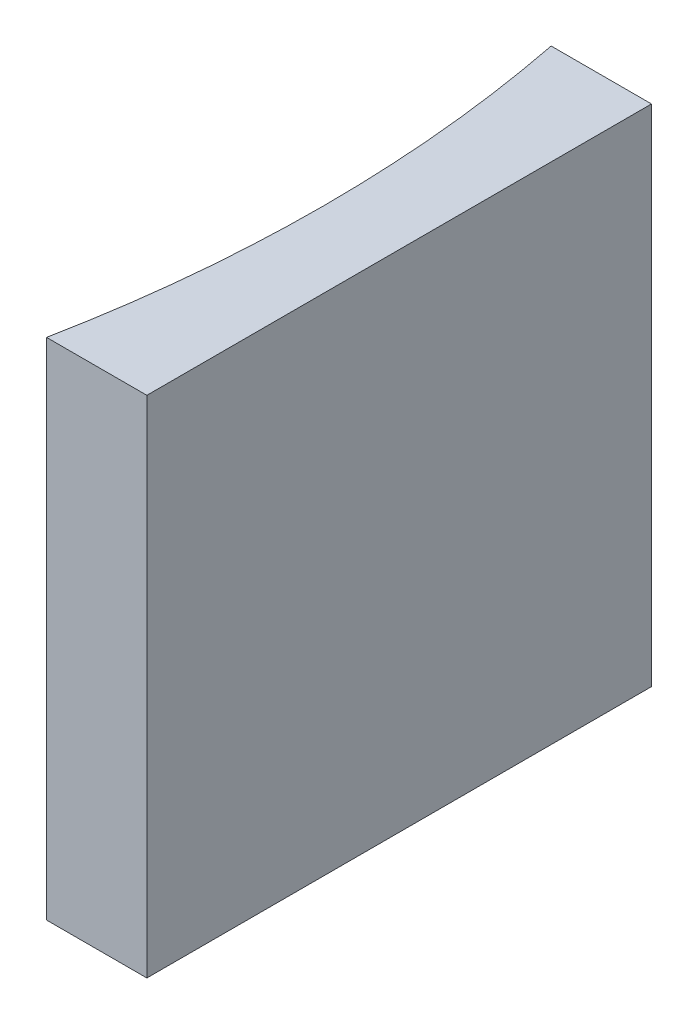
ISO-10303-21;
HEADER;
FILE_DESCRIPTION(('STEP AP214'),'2;1');
FILE_NAME('part.step','',(''),(''),'','','');
FILE_SCHEMA(('AUTOMOTIVE_DESIGN { 1 0 10303 214 1 1 1 1 }'));
ENDSEC;
DATA;
#1=APPLICATION_CONTEXT('core data for automotive mechanical design processes');
#2=APPLICATION_PROTOCOL_DEFINITION('international standard','automotive_design',2000,#1);
#3=PRODUCT_CONTEXT('',#1,'mechanical');
#4=PRODUCT('Part','Part','',(#3));
#5=PRODUCT_RELATED_PRODUCT_CATEGORY('part','',(#4));
#6=PRODUCT_DEFINITION_FORMATION('','',#4);
#7=PRODUCT_DEFINITION_CONTEXT('part definition',#1,'design');
#8=PRODUCT_DEFINITION('design','',#6,#7);
#9=PRODUCT_DEFINITION_SHAPE('','',#8);
#10=(LENGTH_UNIT() NAMED_UNIT(*) SI_UNIT(.MILLI.,.METRE.));
#11=(NAMED_UNIT(*) PLANE_ANGLE_UNIT() SI_UNIT($,.RADIAN.));
#12=(NAMED_UNIT(*) SI_UNIT($,.STERADIAN.) SOLID_ANGLE_UNIT());
#13=UNCERTAINTY_MEASURE_WITH_UNIT(LENGTH_MEASURE(1.E-05),#10,'distance_accuracy_value','');
#14=(GEOMETRIC_REPRESENTATION_CONTEXT(3) GLOBAL_UNCERTAINTY_ASSIGNED_CONTEXT((#13)) GLOBAL_UNIT_ASSIGNED_CONTEXT((#10,
#11,#12)) REPRESENTATION_CONTEXT('',''));
#15=CARTESIAN_POINT('',(0.,0.,0.));
#16=DIRECTION('',(0.,0.,1.));
#17=DIRECTION('',(1.,0.,0.));
#18=AXIS2_PLACEMENT_3D('',#15,#16,#17);
#19=CARTESIAN_POINT('',(0.,20.,0.));
#20=DIRECTION('',(0.,0.,1.));
#21=DIRECTION('',(1.,0.,0.));
#22=AXIS2_PLACEMENT_3D('',#19,#20,#21);
#23=PLANE('',#22);
#24=DIRECTION('',(-1.,0.,0.));
#25=VECTOR('',#24,1.);
#26=CARTESIAN_POINT('',(0.,0.,0.));
#27=LINE('',#26,#25);
#28=CARTESIAN_POINT('',(0.,0.,0.));
#29=VERTEX_POINT('',#28);
#30=CARTESIAN_POINT('',(-3.9774931532203,0.,0.));
#31=VERTEX_POINT('',#30);
#32=EDGE_CURVE('E100',#29,#31,#27,.T.);
#33=ORIENTED_EDGE('',*,*,#32,.T.);
#34=DIRECTION('',(0.,-1.,0.));
#35=VECTOR('',#34,1.);
#36=CARTESIAN_POINT('',(-3.9774931532203,20.,0.));
#37=LINE('',#36,#35);
#38=CARTESIAN_POINT('',(-3.9774931532203,20.,0.));
#39=VERTEX_POINT('',#38);
#40=EDGE_CURVE('E11',#39,#31,#37,.T.);
#41=ORIENTED_EDGE('',*,*,#40,.F.);
#42=DIRECTION('',(-1.,0.,0.));
#43=VECTOR('',#42,1.);
#44=CARTESIAN_POINT('',(0.,20.,0.));
#45=LINE('',#44,#43);
#46=CARTESIAN_POINT('',(0.,20.,0.));
#47=VERTEX_POINT('',#46);
#48=EDGE_CURVE('E88',#47,#39,#45,.T.);
#49=ORIENTED_EDGE('',*,*,#48,.F.);
#50=DIRECTION('',(0.,-1.,0.));
#51=VECTOR('',#50,1.);
#52=CARTESIAN_POINT('',(0.,20.,0.));
#53=LINE('',#52,#51);
#54=EDGE_CURVE('E96',#47,#29,#53,.T.);
#55=ORIENTED_EDGE('',*,*,#54,.T.);
#56=EDGE_LOOP('',(#33,#41,#49,#55));
#57=FACE_BOUND('',#56,.T.);
#58=ADVANCED_FACE('F37',(#57),#23,.F.);
#59=CARTESIAN_POINT('',(-54.64,20.,10.));
#60=DIRECTION('',(0.,-1.,0.));
#61=DIRECTION('',(0.,0.,-1.));
#62=AXIS2_PLACEMENT_3D('',#59,#60,#61);
#63=CYLINDRICAL_SURFACE('',#62,51.64);
#64=CARTESIAN_POINT('',(-54.64,0.,10.));
#65=DIRECTION('',(0.,-1.,0.));
#66=DIRECTION('',(0.,0.,1.));
#67=AXIS2_PLACEMENT_3D('',#64,#65,#66);
#68=CIRCLE('',#67,51.64);
#69=CARTESIAN_POINT('',(-3.9774931532203,0.,20.));
#70=VERTEX_POINT('',#69);
#71=EDGE_CURVE('E92',#31,#70,#68,.T.);
#72=ORIENTED_EDGE('',*,*,#71,.T.);
#73=DIRECTION('',(0.,-1.,0.));
#74=VECTOR('',#73,1.);
#75=CARTESIAN_POINT('',(-3.9774931532203,20.,20.));
#76=LINE('',#75,#74);
#77=CARTESIAN_POINT('',(-3.9774931532203,20.,20.));
#78=VERTEX_POINT('',#77);
#79=EDGE_CURVE('E45',#78,#70,#76,.T.);
#80=ORIENTED_EDGE('',*,*,#79,.F.);
#81=CARTESIAN_POINT('',(-54.64,20.,10.));
#82=DIRECTION('',(0.,-1.,0.));
#83=DIRECTION('',(0.,0.,1.));
#84=AXIS2_PLACEMENT_3D('',#81,#82,#83);
#85=CIRCLE('',#84,51.64);
#86=EDGE_CURVE('E83',#39,#78,#85,.T.);
#87=ORIENTED_EDGE('',*,*,#86,.F.);
#88=ORIENTED_EDGE('',*,*,#40,.T.);
#89=EDGE_LOOP('',(#72,#80,#87,#88));
#90=FACE_BOUND('',#89,.T.);
#91=ADVANCED_FACE('F91',(#90),#63,.F.);
#92=CARTESIAN_POINT('',(0.,20.,20.));
#93=DIRECTION('',(0.,0.,-1.));
#94=DIRECTION('',(-1.,0.,0.));
#95=AXIS2_PLACEMENT_3D('',#92,#93,#94);
#96=PLANE('',#95);
#97=DIRECTION('',(1.,0.,0.));
#98=VECTOR('',#97,1.);
#99=CARTESIAN_POINT('',(0.,0.,20.));
#100=LINE('',#99,#98);
#101=CARTESIAN_POINT('',(0.,0.,20.));
#102=VERTEX_POINT('',#101);
#103=EDGE_CURVE('E70',#70,#102,#100,.T.);
#104=ORIENTED_EDGE('',*,*,#103,.T.);
#105=DIRECTION('',(0.,-1.,0.));
#106=VECTOR('',#105,1.);
#107=CARTESIAN_POINT('',(0.,20.,20.));
#108=LINE('',#107,#106);
#109=CARTESIAN_POINT('',(0.,20.,20.));
#110=VERTEX_POINT('',#109);
#111=EDGE_CURVE('E93',#110,#102,#108,.T.);
#112=ORIENTED_EDGE('',*,*,#111,.F.);
#113=DIRECTION('',(1.,0.,0.));
#114=VECTOR('',#113,1.);
#115=CARTESIAN_POINT('',(0.,20.,20.));
#116=LINE('',#115,#114);
#117=EDGE_CURVE('E86',#78,#110,#116,.T.);
#118=ORIENTED_EDGE('',*,*,#117,.F.);
#119=ORIENTED_EDGE('',*,*,#79,.T.);
#120=EDGE_LOOP('',(#104,#112,#118,#119));
#121=FACE_BOUND('',#120,.T.);
#122=ADVANCED_FACE('F94',(#121),#96,.F.);
#123=CARTESIAN_POINT('',(0.,20.,0.));
#124=DIRECTION('',(-1.,0.,0.));
#125=DIRECTION('',(0.,0.,1.));
#126=AXIS2_PLACEMENT_3D('',#123,#124,#125);
#127=PLANE('',#126);
#128=DIRECTION('',(0.,0.,-1.));
#129=VECTOR('',#128,1.);
#130=CARTESIAN_POINT('',(0.,0.,0.));
#131=LINE('',#130,#129);
#132=EDGE_CURVE('E76',#102,#29,#131,.T.);
#133=ORIENTED_EDGE('',*,*,#132,.T.);
#134=ORIENTED_EDGE('',*,*,#54,.F.);
#135=DIRECTION('',(0.,0.,-1.));
#136=VECTOR('',#135,1.);
#137=CARTESIAN_POINT('',(0.,20.,0.));
#138=LINE('',#137,#136);
#139=EDGE_CURVE('E53',#110,#47,#138,.T.);
#140=ORIENTED_EDGE('',*,*,#139,.F.);
#141=ORIENTED_EDGE('',*,*,#111,.T.);
#142=EDGE_LOOP('',(#133,#134,#140,#141));
#143=FACE_BOUND('',#142,.T.);
#144=ADVANCED_FACE('F107',(#143),#127,.F.);
#145=CARTESIAN_POINT('',(-54.64,20.,10.));
#146=DIRECTION('',(0.,1.,0.));
#147=DIRECTION('',(0.,0.,1.));
#148=AXIS2_PLACEMENT_3D('',#145,#146,#147);
#149=PLANE('',#148);
#150=ORIENTED_EDGE('',*,*,#48,.T.);
#151=ORIENTED_EDGE('',*,*,#86,.T.);
#152=ORIENTED_EDGE('',*,*,#117,.T.);
#153=ORIENTED_EDGE('',*,*,#139,.T.);
#154=EDGE_LOOP('',(#150,#151,#152,#153));
#155=FACE_BOUND('',#154,.T.);
#156=ADVANCED_FACE('F84',(#155),#149,.T.);
#157=CARTESIAN_POINT('',(-54.64,0.,10.));
#158=DIRECTION('',(0.,1.,0.));
#159=DIRECTION('',(0.,0.,1.));
#160=AXIS2_PLACEMENT_3D('',#157,#158,#159);
#161=PLANE('',#160);
#162=ORIENTED_EDGE('',*,*,#32,.F.);
#163=ORIENTED_EDGE('',*,*,#132,.F.);
#164=ORIENTED_EDGE('',*,*,#103,.F.);
#165=ORIENTED_EDGE('',*,*,#71,.F.);
#166=EDGE_LOOP('',(#162,#163,#164,#165));
#167=FACE_BOUND('',#166,.T.);
#168=ADVANCED_FACE('F110',(#167),#161,.F.);
#169=CLOSED_SHELL('',(#58,#91,#122,#144,#156,#168));
#170=MANIFOLD_SOLID_BREP('B2',#169);
#171=ADVANCED_BREP_SHAPE_REPRESENTATION('',(#18,#170),#14);
#172=SHAPE_DEFINITION_REPRESENTATION(#9,#171);
ENDSEC;
END-ISO-10303-21;
